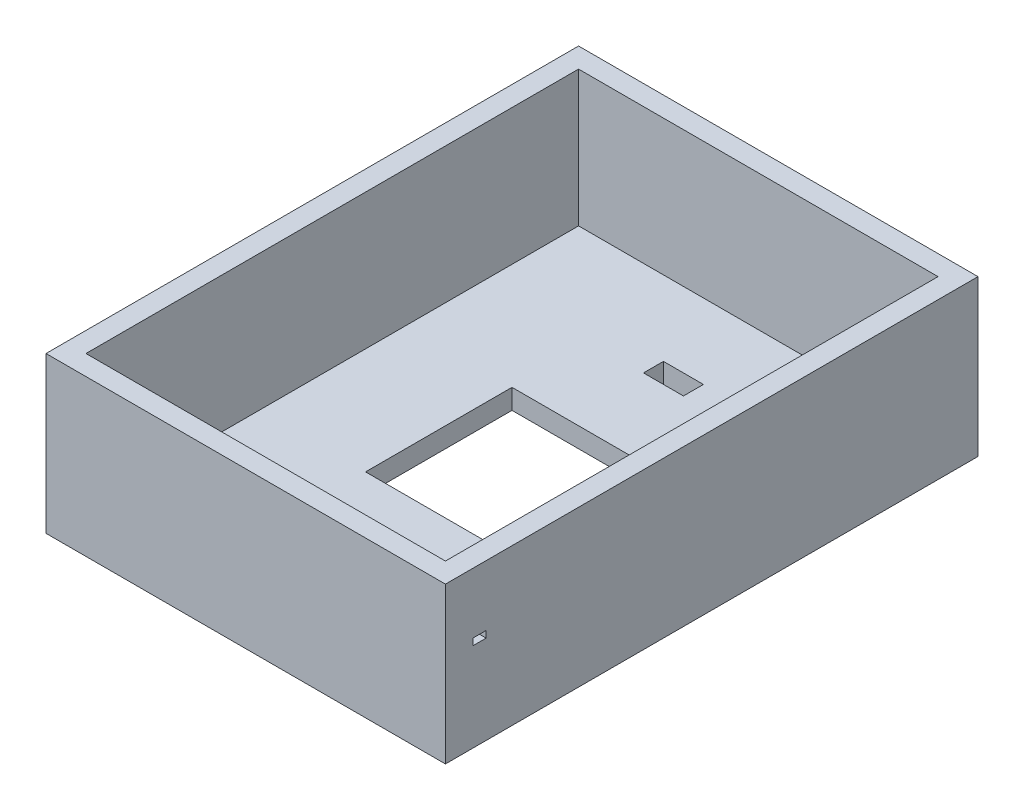
ISO-10303-21;
HEADER;
FILE_DESCRIPTION(('STEP AP214'),'2;1');
FILE_NAME('part.step','',(''),(''),'','','');
FILE_SCHEMA(('AUTOMOTIVE_DESIGN { 1 0 10303 214 1 1 1 1 }'));
ENDSEC;
DATA;
#1=APPLICATION_CONTEXT('core data for automotive mechanical design processes');
#2=APPLICATION_PROTOCOL_DEFINITION('international standard','automotive_design',2000,#1);
#3=PRODUCT_CONTEXT('',#1,'mechanical');
#4=PRODUCT('Part','Part','',(#3));
#5=PRODUCT_RELATED_PRODUCT_CATEGORY('part','',(#4));
#6=PRODUCT_DEFINITION_FORMATION('','',#4);
#7=PRODUCT_DEFINITION_CONTEXT('part definition',#1,'design');
#8=PRODUCT_DEFINITION('design','',#6,#7);
#9=PRODUCT_DEFINITION_SHAPE('','',#8);
#10=(LENGTH_UNIT() NAMED_UNIT(*) SI_UNIT(.MILLI.,.METRE.));
#11=(NAMED_UNIT(*) PLANE_ANGLE_UNIT() SI_UNIT($,.RADIAN.));
#12=(NAMED_UNIT(*) SI_UNIT($,.STERADIAN.) SOLID_ANGLE_UNIT());
#13=UNCERTAINTY_MEASURE_WITH_UNIT(LENGTH_MEASURE(1.E-05),#10,'distance_accuracy_value','');
#14=(GEOMETRIC_REPRESENTATION_CONTEXT(3) GLOBAL_UNCERTAINTY_ASSIGNED_CONTEXT((#13)) GLOBAL_UNIT_ASSIGNED_CONTEXT((#10,
#11,#12)) REPRESENTATION_CONTEXT('',''));
#15=CARTESIAN_POINT('',(0.,0.,0.));
#16=DIRECTION('',(0.,0.,1.));
#17=DIRECTION('',(1.,0.,0.));
#18=AXIS2_PLACEMENT_3D('',#15,#16,#17);
#19=CARTESIAN_POINT('',(150.,117.,200.));
#20=DIRECTION('',(-1.,0.,0.));
#21=DIRECTION('',(0.,0.,1.));
#22=AXIS2_PLACEMENT_3D('',#19,#20,#21);
#23=PLANE('',#22);
#24=DIRECTION('',(0.,0.,1.));
#25=VECTOR('',#24,1.);
#26=CARTESIAN_POINT('',(150.,71.5814194491032,179.402323873395));
#27=LINE('',#26,#25);
#28=CARTESIAN_POINT('',(150.,71.5814194491032,169.402323873395));
#29=VERTEX_POINT('',#28);
#30=CARTESIAN_POINT('',(150.,71.5814194491032,179.402323873395));
#31=VERTEX_POINT('',#30);
#32=EDGE_CURVE('E185',#29,#31,#27,.T.);
#33=ORIENTED_EDGE('',*,*,#32,.F.);
#34=DIRECTION('',(0.,1.,0.));
#35=VECTOR('',#34,1.);
#36=CARTESIAN_POINT('',(150.,71.5814194491032,169.402323873395));
#37=LINE('',#36,#35);
#38=CARTESIAN_POINT('',(150.,66.5814194491032,169.402323873395));
#39=VERTEX_POINT('',#38);
#40=EDGE_CURVE('E51',#39,#29,#37,.T.);
#41=ORIENTED_EDGE('',*,*,#40,.F.);
#42=DIRECTION('',(0.,0.,-1.));
#43=VECTOR('',#42,1.);
#44=CARTESIAN_POINT('',(150.,66.5814194491032,179.402323873395));
#45=LINE('',#44,#43);
#46=CARTESIAN_POINT('',(150.,66.5814194491032,179.402323873395));
#47=VERTEX_POINT('',#46);
#48=EDGE_CURVE('E191',#47,#39,#45,.T.);
#49=ORIENTED_EDGE('',*,*,#48,.F.);
#50=DIRECTION('',(0.,-1.,0.));
#51=VECTOR('',#50,1.);
#52=CARTESIAN_POINT('',(150.,71.5814194491032,179.402323873395));
#53=LINE('',#52,#51);
#54=EDGE_CURVE('E176',#31,#47,#53,.T.);
#55=ORIENTED_EDGE('',*,*,#54,.F.);
#56=EDGE_LOOP('',(#33,#41,#49,#55));
#57=FACE_BOUND('',#56,.T.);
#58=DIRECTION('',(0.,0.,-1.));
#59=VECTOR('',#58,1.);
#60=CARTESIAN_POINT('',(150.,0.,200.));
#61=LINE('',#60,#59);
#62=CARTESIAN_POINT('',(150.,0.,200.));
#63=VERTEX_POINT('',#62);
#64=CARTESIAN_POINT('',(150.,0.,-200.));
#65=VERTEX_POINT('',#64);
#66=EDGE_CURVE('E286',#63,#65,#61,.T.);
#67=ORIENTED_EDGE('',*,*,#66,.T.);
#68=DIRECTION('',(0.,-1.,0.));
#69=VECTOR('',#68,1.);
#70=CARTESIAN_POINT('',(150.,117.,-200.));
#71=LINE('',#70,#69);
#72=CARTESIAN_POINT('',(150.,117.,-200.));
#73=VERTEX_POINT('',#72);
#74=EDGE_CURVE('E321',#73,#65,#71,.T.);
#75=ORIENTED_EDGE('',*,*,#74,.F.);
#76=DIRECTION('',(0.,0.,-1.));
#77=VECTOR('',#76,1.);
#78=CARTESIAN_POINT('',(150.,117.,200.));
#79=LINE('',#78,#77);
#80=CARTESIAN_POINT('',(150.,117.,200.));
#81=VERTEX_POINT('',#80);
#82=EDGE_CURVE('E295',#81,#73,#79,.T.);
#83=ORIENTED_EDGE('',*,*,#82,.F.);
#84=DIRECTION('',(0.,-1.,0.));
#85=VECTOR('',#84,1.);
#86=CARTESIAN_POINT('',(150.,117.,200.));
#87=LINE('',#86,#85);
#88=EDGE_CURVE('E305',#81,#63,#87,.T.);
#89=ORIENTED_EDGE('',*,*,#88,.T.);
#90=EDGE_LOOP('',(#67,#75,#83,#89));
#91=FACE_BOUND('',#90,.T.);
#92=ADVANCED_FACE('F35',(#57,#91),#23,.F.);
#93=CARTESIAN_POINT('',(-150.,117.,-200.));
#94=DIRECTION('',(0.,0.,1.));
#95=DIRECTION('',(1.,0.,0.));
#96=AXIS2_PLACEMENT_3D('',#93,#94,#95);
#97=PLANE('',#96);
#98=DIRECTION('',(-1.,0.,0.));
#99=VECTOR('',#98,1.);
#100=CARTESIAN_POINT('',(-150.,0.,-200.));
#101=LINE('',#100,#99);
#102=CARTESIAN_POINT('',(-150.,0.,-200.));
#103=VERTEX_POINT('',#102);
#104=EDGE_CURVE('E308',#65,#103,#101,.T.);
#105=ORIENTED_EDGE('',*,*,#104,.T.);
#106=DIRECTION('',(0.,-1.,0.));
#107=VECTOR('',#106,1.);
#108=CARTESIAN_POINT('',(-150.,117.,-200.));
#109=LINE('',#108,#107);
#110=CARTESIAN_POINT('',(-150.,117.,-200.));
#111=VERTEX_POINT('',#110);
#112=EDGE_CURVE('E318',#111,#103,#109,.T.);
#113=ORIENTED_EDGE('',*,*,#112,.F.);
#114=DIRECTION('',(-1.,0.,0.));
#115=VECTOR('',#114,1.);
#116=CARTESIAN_POINT('',(-150.,117.,-200.));
#117=LINE('',#116,#115);
#118=EDGE_CURVE('E298',#73,#111,#117,.T.);
#119=ORIENTED_EDGE('',*,*,#118,.F.);
#120=ORIENTED_EDGE('',*,*,#74,.T.);
#121=EDGE_LOOP('',(#105,#113,#119,#120));
#122=FACE_BOUND('',#121,.T.);
#123=ADVANCED_FACE('F406',(#122),#97,.F.);
#124=CARTESIAN_POINT('',(-150.,117.,200.));
#125=DIRECTION('',(1.,0.,0.));
#126=DIRECTION('',(0.,0.,-1.));
#127=AXIS2_PLACEMENT_3D('',#124,#125,#126);
#128=PLANE('',#127);
#129=CARTESIAN_POINT('',(-150.,45.5273160574868,181.740675272734));
#130=DIRECTION('',(-1.,0.,0.));
#131=DIRECTION('',(0.,0.,1.));
#132=AXIS2_PLACEMENT_3D('',#129,#130,#131);
#133=CIRCLE('',#132,2.5);
#134=CARTESIAN_POINT('',(-150.,45.5273160574868,184.240675272734));
#135=VERTEX_POINT('',#134);
#136=EDGE_CURVE('E336',#135,#135,#133,.T.);
#137=ORIENTED_EDGE('',*,*,#136,.F.);
#138=EDGE_LOOP('',(#137));
#139=FACE_BOUND('',#138,.T.);
#140=CARTESIAN_POINT('',(-150.,45.5273160574868,165.218795702485));
#141=DIRECTION('',(-1.,0.,0.));
#142=DIRECTION('',(0.,0.,1.));
#143=AXIS2_PLACEMENT_3D('',#140,#141,#142);
#144=CIRCLE('',#143,2.5);
#145=CARTESIAN_POINT('',(-150.,45.5273160574868,167.718795702485));
#146=VERTEX_POINT('',#145);
#147=EDGE_CURVE('E353',#146,#146,#144,.T.);
#148=ORIENTED_EDGE('',*,*,#147,.F.);
#149=EDGE_LOOP('',(#148));
#150=FACE_BOUND('',#149,.T.);
#151=CARTESIAN_POINT('',(-150.,45.5273160574868,144.153399250419));
#152=DIRECTION('',(-1.,0.,0.));
#153=DIRECTION('',(0.,0.,1.));
#154=AXIS2_PLACEMENT_3D('',#151,#152,#153);
#155=CIRCLE('',#154,2.5);
#156=CARTESIAN_POINT('',(-150.,45.5273160574868,146.653399250419));
#157=VERTEX_POINT('',#156);
#158=EDGE_CURVE('E349',#157,#157,#155,.T.);
#159=ORIENTED_EDGE('',*,*,#158,.F.);
#160=EDGE_LOOP('',(#159));
#161=FACE_BOUND('',#160,.T.);
#162=CARTESIAN_POINT('',(-150.,45.5273160574868,123.088002798352));
#163=DIRECTION('',(-1.,0.,0.));
#164=DIRECTION('',(0.,0.,1.));
#165=AXIS2_PLACEMENT_3D('',#162,#163,#164);
#166=CIRCLE('',#165,2.5);
#167=CARTESIAN_POINT('',(-150.,45.5273160574868,125.588002798352));
#168=VERTEX_POINT('',#167);
#169=EDGE_CURVE('E346',#168,#168,#166,.T.);
#170=ORIENTED_EDGE('',*,*,#169,.F.);
#171=EDGE_LOOP('',(#170));
#172=FACE_BOUND('',#171,.T.);
#173=DIRECTION('',(0.,0.,1.));
#174=VECTOR('',#173,1.);
#175=CARTESIAN_POINT('',(-150.,0.,200.));
#176=LINE('',#175,#174);
#177=CARTESIAN_POINT('',(-150.,0.,200.));
#178=VERTEX_POINT('',#177);
#179=EDGE_CURVE('E310',#103,#178,#176,.T.);
#180=ORIENTED_EDGE('',*,*,#179,.T.);
#181=DIRECTION('',(0.,-1.,0.));
#182=VECTOR('',#181,1.);
#183=CARTESIAN_POINT('',(-150.,117.,200.));
#184=LINE('',#183,#182);
#185=CARTESIAN_POINT('',(-150.,117.,200.));
#186=VERTEX_POINT('',#185);
#187=EDGE_CURVE('E315',#186,#178,#184,.T.);
#188=ORIENTED_EDGE('',*,*,#187,.F.);
#189=DIRECTION('',(0.,0.,1.));
#190=VECTOR('',#189,1.);
#191=CARTESIAN_POINT('',(-150.,117.,200.));
#192=LINE('',#191,#190);
#193=EDGE_CURVE('E301',#111,#186,#192,.T.);
#194=ORIENTED_EDGE('',*,*,#193,.F.);
#195=ORIENTED_EDGE('',*,*,#112,.T.);
#196=EDGE_LOOP('',(#180,#188,#194,#195));
#197=FACE_BOUND('',#196,.T.);
#198=ADVANCED_FACE('F410',(#139,#150,#161,#172,#197),#128,.F.);
#199=CARTESIAN_POINT('',(-150.,117.,200.));
#200=DIRECTION('',(0.,0.,-1.));
#201=DIRECTION('',(-1.,0.,0.));
#202=AXIS2_PLACEMENT_3D('',#199,#200,#201);
#203=PLANE('',#202);
#204=DIRECTION('',(1.,0.,0.));
#205=VECTOR('',#204,1.);
#206=CARTESIAN_POINT('',(-150.,0.,200.));
#207=LINE('',#206,#205);
#208=EDGE_CURVE('E299',#178,#63,#207,.T.);
#209=ORIENTED_EDGE('',*,*,#208,.T.);
#210=ORIENTED_EDGE('',*,*,#88,.F.);
#211=DIRECTION('',(1.,0.,0.));
#212=VECTOR('',#211,1.);
#213=CARTESIAN_POINT('',(-150.,117.,200.));
#214=LINE('',#213,#212);
#215=EDGE_CURVE('E303',#186,#81,#214,.T.);
#216=ORIENTED_EDGE('',*,*,#215,.F.);
#217=ORIENTED_EDGE('',*,*,#187,.T.);
#218=EDGE_LOOP('',(#209,#210,#216,#217));
#219=FACE_BOUND('',#218,.T.);
#220=ADVANCED_FACE('F416',(#219),#203,.F.);
#221=CARTESIAN_POINT('',(0.,117.,0.));
#222=DIRECTION('',(0.,-1.,0.));
#223=DIRECTION('',(0.,0.,-1.));
#224=AXIS2_PLACEMENT_3D('',#221,#222,#223);
#225=PLANE('',#224);
#226=DIRECTION('',(-1.,0.,0.));
#227=VECTOR('',#226,1.);
#228=CARTESIAN_POINT('',(-135.,117.,-185.));
#229=LINE('',#228,#227);
#230=CARTESIAN_POINT('',(135.,117.,-185.));
#231=VERTEX_POINT('',#230);
#232=CARTESIAN_POINT('',(-135.,117.,-185.));
#233=VERTEX_POINT('',#232);
#234=EDGE_CURVE('E245',#231,#233,#229,.T.);
#235=ORIENTED_EDGE('',*,*,#234,.F.);
#236=DIRECTION('',(0.,0.,-1.));
#237=VECTOR('',#236,1.);
#238=CARTESIAN_POINT('',(135.,117.,185.));
#239=LINE('',#238,#237);
#240=CARTESIAN_POINT('',(135.,117.,185.));
#241=VERTEX_POINT('',#240);
#242=EDGE_CURVE('E229',#241,#231,#239,.T.);
#243=ORIENTED_EDGE('',*,*,#242,.F.);
#244=DIRECTION('',(1.,0.,0.));
#245=VECTOR('',#244,1.);
#246=CARTESIAN_POINT('',(-135.,117.,185.));
#247=LINE('',#246,#245);
#248=CARTESIAN_POINT('',(-135.,117.,185.));
#249=VERTEX_POINT('',#248);
#250=EDGE_CURVE('E234',#249,#241,#247,.T.);
#251=ORIENTED_EDGE('',*,*,#250,.F.);
#252=DIRECTION('',(0.,0.,1.));
#253=VECTOR('',#252,1.);
#254=CARTESIAN_POINT('',(-135.,117.,185.));
#255=LINE('',#254,#253);
#256=EDGE_CURVE('E248',#233,#249,#255,.T.);
#257=ORIENTED_EDGE('',*,*,#256,.F.);
#258=EDGE_LOOP('',(#235,#243,#251,#257));
#259=FACE_BOUND('',#258,.T.);
#260=ORIENTED_EDGE('',*,*,#82,.T.);
#261=ORIENTED_EDGE('',*,*,#118,.T.);
#262=ORIENTED_EDGE('',*,*,#193,.T.);
#263=ORIENTED_EDGE('',*,*,#215,.T.);
#264=EDGE_LOOP('',(#260,#261,#262,#263));
#265=FACE_BOUND('',#264,.T.);
#266=ADVANCED_FACE('F400',(#259,#265),#225,.F.);
#267=CARTESIAN_POINT('',(0.,0.,0.));
#268=DIRECTION('',(0.,-1.,0.));
#269=DIRECTION('',(0.,0.,-1.));
#270=AXIS2_PLACEMENT_3D('',#267,#268,#269);
#271=PLANE('',#270);
#272=CARTESIAN_POINT('',(114.515150382083,0.,-165.914920232435));
#273=DIRECTION('',(0.,-1.,0.));
#274=DIRECTION('',(0.,0.,-1.));
#275=AXIS2_PLACEMENT_3D('',#272,#273,#274);
#276=CIRCLE('',#275,4.00000000000001);
#277=CARTESIAN_POINT('',(114.515150382083,0.,-169.914920232435));
#278=VERTEX_POINT('',#277);
#279=EDGE_CURVE('E350',#278,#278,#276,.T.);
#280=ORIENTED_EDGE('',*,*,#279,.F.);
#281=EDGE_LOOP('',(#280));
#282=FACE_BOUND('',#281,.T.);
#283=DIRECTION('',(0.,0.,1.));
#284=VECTOR('',#283,1.);
#285=CARTESIAN_POINT('',(15.,0.,0.));
#286=LINE('',#285,#284);
#287=CARTESIAN_POINT('',(15.,0.,-128.754101576865));
#288=VERTEX_POINT('',#287);
#289=CARTESIAN_POINT('',(15.,0.,-113.754101576865));
#290=VERTEX_POINT('',#289);
#291=EDGE_CURVE('E227',#288,#290,#286,.T.);
#292=ORIENTED_EDGE('',*,*,#291,.F.);
#293=DIRECTION('',(1.,0.,0.));
#294=VECTOR('',#293,1.);
#295=CARTESIAN_POINT('',(0.,0.,-128.754101576865));
#296=LINE('',#295,#294);
#297=CARTESIAN_POINT('',(-15.,0.,-128.754101576865));
#298=VERTEX_POINT('',#297);
#299=EDGE_CURVE('E214',#298,#288,#296,.T.);
#300=ORIENTED_EDGE('',*,*,#299,.F.);
#301=DIRECTION('',(0.,0.,-1.));
#302=VECTOR('',#301,1.);
#303=CARTESIAN_POINT('',(-15.,0.,0.));
#304=LINE('',#303,#302);
#305=CARTESIAN_POINT('',(-15.,0.,-113.754101576865));
#306=VERTEX_POINT('',#305);
#307=EDGE_CURVE('E222',#306,#298,#304,.T.);
#308=ORIENTED_EDGE('',*,*,#307,.F.);
#309=DIRECTION('',(-1.,0.,0.));
#310=VECTOR('',#309,1.);
#311=CARTESIAN_POINT('',(0.,0.,-113.754101576865));
#312=LINE('',#311,#310);
#313=EDGE_CURVE('E225',#290,#306,#312,.T.);
#314=ORIENTED_EDGE('',*,*,#313,.F.);
#315=EDGE_LOOP('',(#292,#300,#308,#314));
#316=FACE_BOUND('',#315,.T.);
#317=DIRECTION('',(0.,0.,-1.));
#318=VECTOR('',#317,1.);
#319=CARTESIAN_POINT('',(55.,0.,55.));
#320=LINE('',#319,#318);
#321=CARTESIAN_POINT('',(55.,0.,55.));
#322=VERTEX_POINT('',#321);
#323=CARTESIAN_POINT('',(55.,0.,-55.));
#324=VERTEX_POINT('',#323);
#325=EDGE_CURVE('E270',#322,#324,#320,.T.);
#326=ORIENTED_EDGE('',*,*,#325,.T.);
#327=DIRECTION('',(-1.,0.,0.));
#328=VECTOR('',#327,1.);
#329=CARTESIAN_POINT('',(-55.,0.,-55.));
#330=LINE('',#329,#328);
#331=CARTESIAN_POINT('',(-55.,0.,-55.));
#332=VERTEX_POINT('',#331);
#333=EDGE_CURVE('E273',#324,#332,#330,.T.);
#334=ORIENTED_EDGE('',*,*,#333,.T.);
#335=DIRECTION('',(0.,0.,1.));
#336=VECTOR('',#335,1.);
#337=CARTESIAN_POINT('',(-55.,0.,55.));
#338=LINE('',#337,#336);
#339=CARTESIAN_POINT('',(-55.,0.,55.));
#340=VERTEX_POINT('',#339);
#341=EDGE_CURVE('E276',#332,#340,#338,.T.);
#342=ORIENTED_EDGE('',*,*,#341,.T.);
#343=DIRECTION('',(1.,0.,0.));
#344=VECTOR('',#343,1.);
#345=CARTESIAN_POINT('',(-55.,0.,55.));
#346=LINE('',#345,#344);
#347=EDGE_CURVE('E279',#340,#322,#346,.T.);
#348=ORIENTED_EDGE('',*,*,#347,.T.);
#349=EDGE_LOOP('',(#326,#334,#342,#348));
#350=FACE_BOUND('',#349,.T.);
#351=ORIENTED_EDGE('',*,*,#66,.F.);
#352=ORIENTED_EDGE('',*,*,#208,.F.);
#353=ORIENTED_EDGE('',*,*,#179,.F.);
#354=ORIENTED_EDGE('',*,*,#104,.F.);
#355=EDGE_LOOP('',(#351,#352,#353,#354));
#356=FACE_BOUND('',#355,.T.);
#357=ADVANCED_FACE('F386',(#282,#316,#350,#356),#271,.T.);
#358=CARTESIAN_POINT('',(55.,0.,55.));
#359=DIRECTION('',(1.,0.,0.));
#360=DIRECTION('',(0.,0.,-1.));
#361=AXIS2_PLACEMENT_3D('',#358,#359,#360);
#362=PLANE('',#361);
#363=DIRECTION('',(0.,1.,0.));
#364=VECTOR('',#363,1.);
#365=CARTESIAN_POINT('',(55.,0.,55.));
#366=LINE('',#365,#364);
#367=CARTESIAN_POINT('',(55.,15.,55.));
#368=VERTEX_POINT('',#367);
#369=EDGE_CURVE('E283',#322,#368,#366,.T.);
#370=ORIENTED_EDGE('',*,*,#369,.T.);
#371=DIRECTION('',(0.,0.,-1.));
#372=VECTOR('',#371,1.);
#373=CARTESIAN_POINT('',(55.,15.,55.));
#374=LINE('',#373,#372);
#375=CARTESIAN_POINT('',(55.,15.,-55.));
#376=VERTEX_POINT('',#375);
#377=EDGE_CURVE('E267',#368,#376,#374,.T.);
#378=ORIENTED_EDGE('',*,*,#377,.T.);
#379=DIRECTION('',(0.,1.,0.));
#380=VECTOR('',#379,1.);
#381=CARTESIAN_POINT('',(55.,0.,-55.));
#382=LINE('',#381,#380);
#383=EDGE_CURVE('E282',#324,#376,#382,.T.);
#384=ORIENTED_EDGE('',*,*,#383,.F.);
#385=ORIENTED_EDGE('',*,*,#325,.F.);
#386=EDGE_LOOP('',(#370,#378,#384,#385));
#387=FACE_BOUND('',#386,.T.);
#388=ADVANCED_FACE('F391',(#387),#362,.F.);
#389=CARTESIAN_POINT('',(-55.,0.,55.));
#390=DIRECTION('',(0.,0.,1.));
#391=DIRECTION('',(1.,0.,0.));
#392=AXIS2_PLACEMENT_3D('',#389,#390,#391);
#393=PLANE('',#392);
#394=DIRECTION('',(0.,1.,0.));
#395=VECTOR('',#394,1.);
#396=CARTESIAN_POINT('',(-55.,0.,55.));
#397=LINE('',#396,#395);
#398=CARTESIAN_POINT('',(-55.,15.,55.));
#399=VERTEX_POINT('',#398);
#400=EDGE_CURVE('E287',#340,#399,#397,.T.);
#401=ORIENTED_EDGE('',*,*,#400,.T.);
#402=DIRECTION('',(1.,0.,0.));
#403=VECTOR('',#402,1.);
#404=CARTESIAN_POINT('',(-55.,15.,55.));
#405=LINE('',#404,#403);
#406=EDGE_CURVE('E264',#399,#368,#405,.T.);
#407=ORIENTED_EDGE('',*,*,#406,.T.);
#408=ORIENTED_EDGE('',*,*,#369,.F.);
#409=ORIENTED_EDGE('',*,*,#347,.F.);
#410=EDGE_LOOP('',(#401,#407,#408,#409));
#411=FACE_BOUND('',#410,.T.);
#412=ADVANCED_FACE('F383',(#411),#393,.F.);
#413=CARTESIAN_POINT('',(-55.,0.,55.));
#414=DIRECTION('',(-1.,0.,0.));
#415=DIRECTION('',(0.,0.,1.));
#416=AXIS2_PLACEMENT_3D('',#413,#414,#415);
#417=PLANE('',#416);
#418=DIRECTION('',(0.,1.,0.));
#419=VECTOR('',#418,1.);
#420=CARTESIAN_POINT('',(-55.,0.,-55.));
#421=LINE('',#420,#419);
#422=CARTESIAN_POINT('',(-55.,15.,-55.));
#423=VERTEX_POINT('',#422);
#424=EDGE_CURVE('E290',#332,#423,#421,.T.);
#425=ORIENTED_EDGE('',*,*,#424,.T.);
#426=DIRECTION('',(0.,0.,1.));
#427=VECTOR('',#426,1.);
#428=CARTESIAN_POINT('',(-55.,15.,55.));
#429=LINE('',#428,#427);
#430=EDGE_CURVE('E255',#423,#399,#429,.T.);
#431=ORIENTED_EDGE('',*,*,#430,.T.);
#432=ORIENTED_EDGE('',*,*,#400,.F.);
#433=ORIENTED_EDGE('',*,*,#341,.F.);
#434=EDGE_LOOP('',(#425,#431,#432,#433));
#435=FACE_BOUND('',#434,.T.);
#436=ADVANCED_FACE('F380',(#435),#417,.F.);
#437=CARTESIAN_POINT('',(-55.,0.,-55.));
#438=DIRECTION('',(0.,0.,-1.));
#439=DIRECTION('',(-1.,0.,0.));
#440=AXIS2_PLACEMENT_3D('',#437,#438,#439);
#441=PLANE('',#440);
#442=ORIENTED_EDGE('',*,*,#383,.T.);
#443=DIRECTION('',(-1.,0.,0.));
#444=VECTOR('',#443,1.);
#445=CARTESIAN_POINT('',(-55.,15.,-55.));
#446=LINE('',#445,#444);
#447=EDGE_CURVE('E324',#376,#423,#446,.T.);
#448=ORIENTED_EDGE('',*,*,#447,.T.);
#449=ORIENTED_EDGE('',*,*,#424,.F.);
#450=ORIENTED_EDGE('',*,*,#333,.F.);
#451=EDGE_LOOP('',(#442,#448,#449,#450));
#452=FACE_BOUND('',#451,.T.);
#453=ADVANCED_FACE('F370',(#452),#441,.F.);
#454=CARTESIAN_POINT('',(0.,15.,0.));
#455=DIRECTION('',(0.,-1.,0.));
#456=DIRECTION('',(0.,0.,-1.));
#457=AXIS2_PLACEMENT_3D('',#454,#455,#456);
#458=PLANE('',#457);
#459=CARTESIAN_POINT('',(114.515150382083,15.,-165.914920232435));
#460=DIRECTION('',(0.,1.,0.));
#461=DIRECTION('',(0.,0.,1.));
#462=AXIS2_PLACEMENT_3D('',#459,#460,#461);
#463=CIRCLE('',#462,4.00000000000001);
#464=CARTESIAN_POINT('',(114.515150382083,15.,-161.914920232435));
#465=VERTEX_POINT('',#464);
#466=EDGE_CURVE('E360',#465,#465,#463,.T.);
#467=ORIENTED_EDGE('',*,*,#466,.F.);
#468=EDGE_LOOP('',(#467));
#469=FACE_BOUND('',#468,.T.);
#470=DIRECTION('',(-1.,0.,0.));
#471=VECTOR('',#470,1.);
#472=CARTESIAN_POINT('',(-15.,15.,-128.754101576865));
#473=LINE('',#472,#471);
#474=CARTESIAN_POINT('',(15.,15.,-128.754101576865));
#475=VERTEX_POINT('',#474);
#476=CARTESIAN_POINT('',(-15.,15.,-128.754101576865));
#477=VERTEX_POINT('',#476);
#478=EDGE_CURVE('E202',#475,#477,#473,.T.);
#479=ORIENTED_EDGE('',*,*,#478,.F.);
#480=DIRECTION('',(0.,0.,-1.));
#481=VECTOR('',#480,1.);
#482=CARTESIAN_POINT('',(15.,15.,-128.754101576865));
#483=LINE('',#482,#481);
#484=CARTESIAN_POINT('',(15.,15.,-113.754101576865));
#485=VERTEX_POINT('',#484);
#486=EDGE_CURVE('E198',#485,#475,#483,.T.);
#487=ORIENTED_EDGE('',*,*,#486,.F.);
#488=DIRECTION('',(1.,0.,0.));
#489=VECTOR('',#488,1.);
#490=CARTESIAN_POINT('',(-15.,15.,-113.754101576865));
#491=LINE('',#490,#489);
#492=CARTESIAN_POINT('',(-15.,15.,-113.754101576865));
#493=VERTEX_POINT('',#492);
#494=EDGE_CURVE('E208',#493,#485,#491,.T.);
#495=ORIENTED_EDGE('',*,*,#494,.F.);
#496=DIRECTION('',(0.,0.,1.));
#497=VECTOR('',#496,1.);
#498=CARTESIAN_POINT('',(-15.,15.,-128.754101576865));
#499=LINE('',#498,#497);
#500=EDGE_CURVE('E205',#477,#493,#499,.T.);
#501=ORIENTED_EDGE('',*,*,#500,.F.);
#502=EDGE_LOOP('',(#479,#487,#495,#501));
#503=FACE_BOUND('',#502,.T.);
#504=DIRECTION('',(0.,0.,-1.));
#505=VECTOR('',#504,1.);
#506=CARTESIAN_POINT('',(135.,15.,185.));
#507=LINE('',#506,#505);
#508=CARTESIAN_POINT('',(135.,15.,185.));
#509=VERTEX_POINT('',#508);
#510=CARTESIAN_POINT('',(135.,15.,-185.));
#511=VERTEX_POINT('',#510);
#512=EDGE_CURVE('E230',#509,#511,#507,.T.);
#513=ORIENTED_EDGE('',*,*,#512,.T.);
#514=DIRECTION('',(-1.,0.,0.));
#515=VECTOR('',#514,1.);
#516=CARTESIAN_POINT('',(-135.,15.,-185.));
#517=LINE('',#516,#515);
#518=CARTESIAN_POINT('',(-135.,15.,-185.));
#519=VERTEX_POINT('',#518);
#520=EDGE_CURVE('E233',#511,#519,#517,.T.);
#521=ORIENTED_EDGE('',*,*,#520,.T.);
#522=DIRECTION('',(0.,0.,1.));
#523=VECTOR('',#522,1.);
#524=CARTESIAN_POINT('',(-135.,15.,185.));
#525=LINE('',#524,#523);
#526=CARTESIAN_POINT('',(-135.,15.,185.));
#527=VERTEX_POINT('',#526);
#528=EDGE_CURVE('E237',#519,#527,#525,.T.);
#529=ORIENTED_EDGE('',*,*,#528,.T.);
#530=DIRECTION('',(1.,0.,0.));
#531=VECTOR('',#530,1.);
#532=CARTESIAN_POINT('',(-135.,15.,185.));
#533=LINE('',#532,#531);
#534=EDGE_CURVE('E240',#527,#509,#533,.T.);
#535=ORIENTED_EDGE('',*,*,#534,.T.);
#536=EDGE_LOOP('',(#513,#521,#529,#535));
#537=FACE_BOUND('',#536,.T.);
#538=ORIENTED_EDGE('',*,*,#406,.F.);
#539=ORIENTED_EDGE('',*,*,#430,.F.);
#540=ORIENTED_EDGE('',*,*,#447,.F.);
#541=ORIENTED_EDGE('',*,*,#377,.F.);
#542=EDGE_LOOP('',(#538,#539,#540,#541));
#543=FACE_BOUND('',#542,.T.);
#544=ADVANCED_FACE('F366',(#469,#503,#537,#543),#458,.F.);
#545=CARTESIAN_POINT('',(135.,15.,185.));
#546=DIRECTION('',(1.,0.,0.));
#547=DIRECTION('',(0.,0.,-1.));
#548=AXIS2_PLACEMENT_3D('',#545,#546,#547);
#549=PLANE('',#548);
#550=DIRECTION('',(0.,0.,-1.));
#551=VECTOR('',#550,1.);
#552=CARTESIAN_POINT('',(135.,66.5814194491032,185.));
#553=LINE('',#552,#551);
#554=CARTESIAN_POINT('',(135.,66.5814194491032,179.402323873395));
#555=VERTEX_POINT('',#554);
#556=CARTESIAN_POINT('',(135.,66.5814194491032,169.402323873395));
#557=VERTEX_POINT('',#556);
#558=EDGE_CURVE('E43',#555,#557,#553,.T.);
#559=ORIENTED_EDGE('',*,*,#558,.T.);
#560=DIRECTION('',(0.,1.,0.));
#561=VECTOR('',#560,1.);
#562=CARTESIAN_POINT('',(135.,15.,169.402323873395));
#563=LINE('',#562,#561);
#564=CARTESIAN_POINT('',(135.,71.5814194491032,169.402323873395));
#565=VERTEX_POINT('',#564);
#566=EDGE_CURVE('E11',#557,#565,#563,.T.);
#567=ORIENTED_EDGE('',*,*,#566,.T.);
#568=DIRECTION('',(0.,0.,1.));
#569=VECTOR('',#568,1.);
#570=CARTESIAN_POINT('',(135.,71.5814194491032,185.));
#571=LINE('',#570,#569);
#572=CARTESIAN_POINT('',(135.,71.5814194491032,179.402323873395));
#573=VERTEX_POINT('',#572);
#574=EDGE_CURVE('E327',#565,#573,#571,.T.);
#575=ORIENTED_EDGE('',*,*,#574,.T.);
#576=DIRECTION('',(0.,-1.,0.));
#577=VECTOR('',#576,1.);
#578=CARTESIAN_POINT('',(135.,15.,179.402323873395));
#579=LINE('',#578,#577);
#580=EDGE_CURVE('E179',#573,#555,#579,.T.);
#581=ORIENTED_EDGE('',*,*,#580,.T.);
#582=EDGE_LOOP('',(#559,#567,#575,#581));
#583=FACE_BOUND('',#582,.T.);
#584=ORIENTED_EDGE('',*,*,#242,.T.);
#585=DIRECTION('',(0.,1.,0.));
#586=VECTOR('',#585,1.);
#587=CARTESIAN_POINT('',(135.,15.,-185.));
#588=LINE('',#587,#586);
#589=EDGE_CURVE('E243',#511,#231,#588,.T.);
#590=ORIENTED_EDGE('',*,*,#589,.F.);
#591=ORIENTED_EDGE('',*,*,#512,.F.);
#592=DIRECTION('',(0.,1.,0.));
#593=VECTOR('',#592,1.);
#594=CARTESIAN_POINT('',(135.,15.,185.));
#595=LINE('',#594,#593);
#596=EDGE_CURVE('E253',#509,#241,#595,.T.);
#597=ORIENTED_EDGE('',*,*,#596,.T.);
#598=EDGE_LOOP('',(#584,#590,#591,#597));
#599=FACE_BOUND('',#598,.T.);
#600=ADVANCED_FACE('F369',(#583,#599),#549,.F.);
#601=CARTESIAN_POINT('',(-135.,15.,185.));
#602=DIRECTION('',(0.,0.,1.));
#603=DIRECTION('',(1.,0.,0.));
#604=AXIS2_PLACEMENT_3D('',#601,#602,#603);
#605=PLANE('',#604);
#606=ORIENTED_EDGE('',*,*,#250,.T.);
#607=ORIENTED_EDGE('',*,*,#596,.F.);
#608=ORIENTED_EDGE('',*,*,#534,.F.);
#609=DIRECTION('',(0.,1.,0.));
#610=VECTOR('',#609,1.);
#611=CARTESIAN_POINT('',(-135.,15.,185.));
#612=LINE('',#611,#610);
#613=EDGE_CURVE('E256',#527,#249,#612,.T.);
#614=ORIENTED_EDGE('',*,*,#613,.T.);
#615=EDGE_LOOP('',(#606,#607,#608,#614));
#616=FACE_BOUND('',#615,.T.);
#617=ADVANCED_FACE('F449',(#616),#605,.F.);
#618=CARTESIAN_POINT('',(-135.,15.,185.));
#619=DIRECTION('',(-1.,0.,0.));
#620=DIRECTION('',(0.,0.,1.));
#621=AXIS2_PLACEMENT_3D('',#618,#619,#620);
#622=PLANE('',#621);
#623=CARTESIAN_POINT('',(-135.,45.5273160574868,181.740675272734));
#624=DIRECTION('',(-1.,0.,0.));
#625=DIRECTION('',(0.,0.,1.));
#626=AXIS2_PLACEMENT_3D('',#623,#624,#625);
#627=CIRCLE('',#626,2.5);
#628=CARTESIAN_POINT('',(-135.,45.5273160574868,184.240675272734));
#629=VERTEX_POINT('',#628);
#630=EDGE_CURVE('E38',#629,#629,#627,.T.);
#631=ORIENTED_EDGE('',*,*,#630,.T.);
#632=EDGE_LOOP('',(#631));
#633=FACE_BOUND('',#632,.T.);
#634=CARTESIAN_POINT('',(-135.,45.5273160574868,165.218795702485));
#635=DIRECTION('',(-1.,0.,0.));
#636=DIRECTION('',(0.,0.,1.));
#637=AXIS2_PLACEMENT_3D('',#634,#635,#636);
#638=CIRCLE('',#637,2.5);
#639=CARTESIAN_POINT('',(-135.,45.5273160574868,167.718795702485));
#640=VERTEX_POINT('',#639);
#641=EDGE_CURVE('E338',#640,#640,#638,.T.);
#642=ORIENTED_EDGE('',*,*,#641,.T.);
#643=EDGE_LOOP('',(#642));
#644=FACE_BOUND('',#643,.T.);
#645=CARTESIAN_POINT('',(-135.,45.5273160574868,144.153399250419));
#646=DIRECTION('',(-1.,0.,0.));
#647=DIRECTION('',(0.,0.,1.));
#648=AXIS2_PLACEMENT_3D('',#645,#646,#647);
#649=CIRCLE('',#648,2.5);
#650=CARTESIAN_POINT('',(-135.,45.5273160574868,146.653399250419));
#651=VERTEX_POINT('',#650);
#652=EDGE_CURVE('E335',#651,#651,#649,.T.);
#653=ORIENTED_EDGE('',*,*,#652,.T.);
#654=EDGE_LOOP('',(#653));
#655=FACE_BOUND('',#654,.T.);
#656=CARTESIAN_POINT('',(-135.,45.5273160574868,123.088002798352));
#657=DIRECTION('',(-1.,0.,0.));
#658=DIRECTION('',(0.,0.,1.));
#659=AXIS2_PLACEMENT_3D('',#656,#657,#658);
#660=CIRCLE('',#659,2.5);
#661=CARTESIAN_POINT('',(-135.,45.5273160574868,125.588002798352));
#662=VERTEX_POINT('',#661);
#663=EDGE_CURVE('E332',#662,#662,#660,.T.);
#664=ORIENTED_EDGE('',*,*,#663,.T.);
#665=EDGE_LOOP('',(#664));
#666=FACE_BOUND('',#665,.T.);
#667=ORIENTED_EDGE('',*,*,#256,.T.);
#668=ORIENTED_EDGE('',*,*,#613,.F.);
#669=ORIENTED_EDGE('',*,*,#528,.F.);
#670=DIRECTION('',(0.,1.,0.));
#671=VECTOR('',#670,1.);
#672=CARTESIAN_POINT('',(-135.,15.,-185.));
#673=LINE('',#672,#671);
#674=EDGE_CURVE('E258',#519,#233,#673,.T.);
#675=ORIENTED_EDGE('',*,*,#674,.T.);
#676=EDGE_LOOP('',(#667,#668,#669,#675));
#677=FACE_BOUND('',#676,.T.);
#678=ADVANCED_FACE('F451',(#633,#644,#655,#666,#677),#622,.F.);
#679=CARTESIAN_POINT('',(-135.,15.,-185.));
#680=DIRECTION('',(0.,0.,-1.));
#681=DIRECTION('',(-1.,0.,0.));
#682=AXIS2_PLACEMENT_3D('',#679,#680,#681);
#683=PLANE('',#682);
#684=ORIENTED_EDGE('',*,*,#234,.T.);
#685=ORIENTED_EDGE('',*,*,#674,.F.);
#686=ORIENTED_EDGE('',*,*,#520,.F.);
#687=ORIENTED_EDGE('',*,*,#589,.T.);
#688=EDGE_LOOP('',(#684,#685,#686,#687));
#689=FACE_BOUND('',#688,.T.);
#690=ADVANCED_FACE('F443',(#689),#683,.F.);
#691=CARTESIAN_POINT('',(15.,-87.,-128.754101576865));
#692=DIRECTION('',(1.,0.,0.));
#693=DIRECTION('',(0.,0.,-1.));
#694=AXIS2_PLACEMENT_3D('',#691,#692,#693);
#695=PLANE('',#694);
#696=ORIENTED_EDGE('',*,*,#291,.T.);
#697=DIRECTION('',(0.,1.,0.));
#698=VECTOR('',#697,1.);
#699=CARTESIAN_POINT('',(15.,-87.,-113.754101576865));
#700=LINE('',#699,#698);
#701=EDGE_CURVE('E212',#290,#485,#700,.T.);
#702=ORIENTED_EDGE('',*,*,#701,.T.);
#703=ORIENTED_EDGE('',*,*,#486,.T.);
#704=DIRECTION('',(0.,1.,0.));
#705=VECTOR('',#704,1.);
#706=CARTESIAN_POINT('',(15.,-87.,-128.754101576865));
#707=LINE('',#706,#705);
#708=EDGE_CURVE('E211',#288,#475,#707,.T.);
#709=ORIENTED_EDGE('',*,*,#708,.F.);
#710=EDGE_LOOP('',(#696,#702,#703,#709));
#711=FACE_BOUND('',#710,.T.);
#712=ADVANCED_FACE('F458',(#711),#695,.F.);
#713=CARTESIAN_POINT('',(-15.,-87.,-113.754101576865));
#714=DIRECTION('',(0.,0.,1.));
#715=DIRECTION('',(1.,0.,0.));
#716=AXIS2_PLACEMENT_3D('',#713,#714,#715);
#717=PLANE('',#716);
#718=ORIENTED_EDGE('',*,*,#313,.T.);
#719=DIRECTION('',(0.,1.,0.));
#720=VECTOR('',#719,1.);
#721=CARTESIAN_POINT('',(-15.,-87.,-113.754101576865));
#722=LINE('',#721,#720);
#723=EDGE_CURVE('E215',#306,#493,#722,.T.);
#724=ORIENTED_EDGE('',*,*,#723,.T.);
#725=ORIENTED_EDGE('',*,*,#494,.T.);
#726=ORIENTED_EDGE('',*,*,#701,.F.);
#727=EDGE_LOOP('',(#718,#724,#725,#726));
#728=FACE_BOUND('',#727,.T.);
#729=ADVANCED_FACE('F502',(#728),#717,.F.);
#730=CARTESIAN_POINT('',(-15.,-87.,-128.754101576865));
#731=DIRECTION('',(-1.,0.,0.));
#732=DIRECTION('',(0.,0.,1.));
#733=AXIS2_PLACEMENT_3D('',#730,#731,#732);
#734=PLANE('',#733);
#735=ORIENTED_EDGE('',*,*,#307,.T.);
#736=DIRECTION('',(0.,1.,0.));
#737=VECTOR('',#736,1.);
#738=CARTESIAN_POINT('',(-15.,-87.,-128.754101576865));
#739=LINE('',#738,#737);
#740=EDGE_CURVE('E217',#298,#477,#739,.T.);
#741=ORIENTED_EDGE('',*,*,#740,.T.);
#742=ORIENTED_EDGE('',*,*,#500,.T.);
#743=ORIENTED_EDGE('',*,*,#723,.F.);
#744=EDGE_LOOP('',(#735,#741,#742,#743));
#745=FACE_BOUND('',#744,.T.);
#746=ADVANCED_FACE('F510',(#745),#734,.F.);
#747=CARTESIAN_POINT('',(-15.,-87.,-128.754101576865));
#748=DIRECTION('',(0.,0.,-1.));
#749=DIRECTION('',(-1.,0.,0.));
#750=AXIS2_PLACEMENT_3D('',#747,#748,#749);
#751=PLANE('',#750);
#752=ORIENTED_EDGE('',*,*,#299,.T.);
#753=ORIENTED_EDGE('',*,*,#708,.T.);
#754=ORIENTED_EDGE('',*,*,#478,.T.);
#755=ORIENTED_EDGE('',*,*,#740,.F.);
#756=EDGE_LOOP('',(#752,#753,#754,#755));
#757=FACE_BOUND('',#756,.T.);
#758=ADVANCED_FACE('F518',(#757),#751,.F.);
#759=CARTESIAN_POINT('',(60.,71.5814194491032,169.402323873395));
#760=DIRECTION('',(0.,0.,-1.));
#761=DIRECTION('',(-1.,0.,0.));
#762=AXIS2_PLACEMENT_3D('',#759,#760,#761);
#763=PLANE('',#762);
#764=DIRECTION('',(1.,0.,0.));
#765=VECTOR('',#764,1.);
#766=CARTESIAN_POINT('',(60.,66.5814194491032,169.402323873395));
#767=LINE('',#766,#765);
#768=EDGE_CURVE('E196',#557,#39,#767,.T.);
#769=ORIENTED_EDGE('',*,*,#768,.T.);
#770=ORIENTED_EDGE('',*,*,#40,.T.);
#771=DIRECTION('',(1.,0.,0.));
#772=VECTOR('',#771,1.);
#773=CARTESIAN_POINT('',(60.,71.5814194491032,169.402323873395));
#774=LINE('',#773,#772);
#775=EDGE_CURVE('E182',#565,#29,#774,.T.);
#776=ORIENTED_EDGE('',*,*,#775,.F.);
#777=ORIENTED_EDGE('',*,*,#566,.F.);
#778=EDGE_LOOP('',(#769,#770,#776,#777));
#779=FACE_BOUND('',#778,.T.);
#780=ADVANCED_FACE('F526',(#779),#763,.F.);
#781=CARTESIAN_POINT('',(60.,66.5814194491032,179.402323873395));
#782=DIRECTION('',(0.,-1.,0.));
#783=DIRECTION('',(0.,0.,-1.));
#784=AXIS2_PLACEMENT_3D('',#781,#782,#783);
#785=PLANE('',#784);
#786=DIRECTION('',(1.,0.,0.));
#787=VECTOR('',#786,1.);
#788=CARTESIAN_POINT('',(60.,66.5814194491032,179.402323873395));
#789=LINE('',#788,#787);
#790=EDGE_CURVE('E181',#555,#47,#789,.T.);
#791=ORIENTED_EDGE('',*,*,#790,.T.);
#792=ORIENTED_EDGE('',*,*,#48,.T.);
#793=ORIENTED_EDGE('',*,*,#768,.F.);
#794=ORIENTED_EDGE('',*,*,#558,.F.);
#795=EDGE_LOOP('',(#791,#792,#793,#794));
#796=FACE_BOUND('',#795,.T.);
#797=ADVANCED_FACE('F533',(#796),#785,.F.);
#798=CARTESIAN_POINT('',(60.,71.5814194491032,179.402323873395));
#799=DIRECTION('',(0.,0.,1.));
#800=DIRECTION('',(1.,0.,0.));
#801=AXIS2_PLACEMENT_3D('',#798,#799,#800);
#802=PLANE('',#801);
#803=DIRECTION('',(1.,0.,0.));
#804=VECTOR('',#803,1.);
#805=CARTESIAN_POINT('',(60.,71.5814194491032,179.402323873395));
#806=LINE('',#805,#804);
#807=EDGE_CURVE('E59',#573,#31,#806,.T.);
#808=ORIENTED_EDGE('',*,*,#807,.T.);
#809=ORIENTED_EDGE('',*,*,#54,.T.);
#810=ORIENTED_EDGE('',*,*,#790,.F.);
#811=ORIENTED_EDGE('',*,*,#580,.F.);
#812=EDGE_LOOP('',(#808,#809,#810,#811));
#813=FACE_BOUND('',#812,.T.);
#814=ADVANCED_FACE('F173',(#813),#802,.F.);
#815=CARTESIAN_POINT('',(60.,71.5814194491032,179.402323873395));
#816=DIRECTION('',(0.,1.,0.));
#817=DIRECTION('',(0.,0.,1.));
#818=AXIS2_PLACEMENT_3D('',#815,#816,#817);
#819=PLANE('',#818);
#820=ORIENTED_EDGE('',*,*,#775,.T.);
#821=ORIENTED_EDGE('',*,*,#32,.T.);
#822=ORIENTED_EDGE('',*,*,#807,.F.);
#823=ORIENTED_EDGE('',*,*,#574,.F.);
#824=EDGE_LOOP('',(#820,#821,#822,#823));
#825=FACE_BOUND('',#824,.T.);
#826=ADVANCED_FACE('F186',(#825),#819,.F.);
#827=CARTESIAN_POINT('',(-60.,45.5273160574868,123.088002798352));
#828=DIRECTION('',(-1.,0.,0.));
#829=DIRECTION('',(0.,0.,1.));
#830=AXIS2_PLACEMENT_3D('',#827,#828,#829);
#831=CYLINDRICAL_SURFACE('',#830,2.5);
#832=ORIENTED_EDGE('',*,*,#169,.T.);
#833=EDGE_LOOP('',(#832));
#834=FACE_BOUND('',#833,.T.);
#835=ORIENTED_EDGE('',*,*,#663,.F.);
#836=EDGE_LOOP('',(#835));
#837=FACE_BOUND('',#836,.T.);
#838=ADVANCED_FACE('F553',(#834,#837),#831,.F.);
#839=CARTESIAN_POINT('',(-60.,45.5273160574868,144.153399250419));
#840=DIRECTION('',(-1.,0.,0.));
#841=DIRECTION('',(0.,0.,1.));
#842=AXIS2_PLACEMENT_3D('',#839,#840,#841);
#843=CYLINDRICAL_SURFACE('',#842,2.5);
#844=ORIENTED_EDGE('',*,*,#158,.T.);
#845=EDGE_LOOP('',(#844));
#846=FACE_BOUND('',#845,.T.);
#847=ORIENTED_EDGE('',*,*,#652,.F.);
#848=EDGE_LOOP('',(#847));
#849=FACE_BOUND('',#848,.T.);
#850=ADVANCED_FACE('F559',(#846,#849),#843,.F.);
#851=CARTESIAN_POINT('',(-60.,45.5273160574868,165.218795702485));
#852=DIRECTION('',(-1.,0.,0.));
#853=DIRECTION('',(0.,0.,1.));
#854=AXIS2_PLACEMENT_3D('',#851,#852,#853);
#855=CYLINDRICAL_SURFACE('',#854,2.5);
#856=ORIENTED_EDGE('',*,*,#147,.T.);
#857=EDGE_LOOP('',(#856));
#858=FACE_BOUND('',#857,.T.);
#859=ORIENTED_EDGE('',*,*,#641,.F.);
#860=EDGE_LOOP('',(#859));
#861=FACE_BOUND('',#860,.T.);
#862=ADVANCED_FACE('F567',(#858,#861),#855,.F.);
#863=CARTESIAN_POINT('',(-60.,45.5273160574868,181.740675272734));
#864=DIRECTION('',(-1.,0.,0.));
#865=DIRECTION('',(0.,0.,1.));
#866=AXIS2_PLACEMENT_3D('',#863,#864,#865);
#867=CYLINDRICAL_SURFACE('',#866,2.5);
#868=ORIENTED_EDGE('',*,*,#136,.T.);
#869=EDGE_LOOP('',(#868));
#870=FACE_BOUND('',#869,.T.);
#871=ORIENTED_EDGE('',*,*,#630,.F.);
#872=EDGE_LOOP('',(#871));
#873=FACE_BOUND('',#872,.T.);
#874=ADVANCED_FACE('F575',(#870,#873),#867,.F.);
#875=CARTESIAN_POINT('',(114.515150382083,-75.,-165.914920232435));
#876=DIRECTION('',(0.,1.,0.));
#877=DIRECTION('',(0.,0.,1.));
#878=AXIS2_PLACEMENT_3D('',#875,#876,#877);
#879=CYLINDRICAL_SURFACE('',#878,4.00000000000001);
#880=ORIENTED_EDGE('',*,*,#279,.T.);
#881=EDGE_LOOP('',(#880));
#882=FACE_BOUND('',#881,.T.);
#883=ORIENTED_EDGE('',*,*,#466,.T.);
#884=EDGE_LOOP('',(#883));
#885=FACE_BOUND('',#884,.T.);
#886=ADVANCED_FACE('F364',(#882,#885),#879,.F.);
#887=CLOSED_SHELL('',(#92,#123,#198,#220,#266,#357,#388,#412,#436,#453,#544,#600,#617,#678,#690,
#712,#729,#746,#758,#780,#797,#814,#826,#838,#850,#862,#874,#886));
#888=MANIFOLD_SOLID_BREP('B2',#887);
#889=ADVANCED_BREP_SHAPE_REPRESENTATION('',(#18,#888),#14);
#890=SHAPE_DEFINITION_REPRESENTATION(#9,#889);
ENDSEC;
END-ISO-10303-21;
